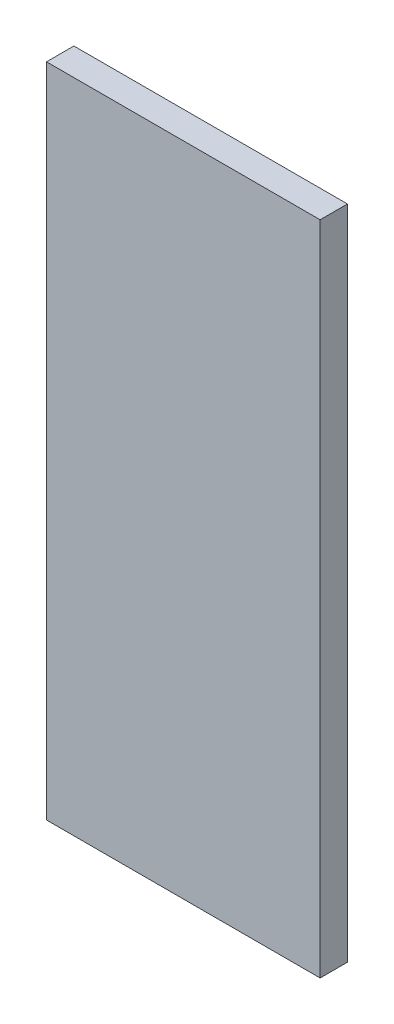
ISO-10303-21;
HEADER;
FILE_DESCRIPTION(('STEP AP214'),'2;1');
FILE_NAME('part.step','',(''),(''),'','','');
FILE_SCHEMA(('AUTOMOTIVE_DESIGN { 1 0 10303 214 1 1 1 1 }'));
ENDSEC;
DATA;
#1=APPLICATION_CONTEXT('core data for automotive mechanical design processes');
#2=APPLICATION_PROTOCOL_DEFINITION('international standard','automotive_design',2000,#1);
#3=PRODUCT_CONTEXT('',#1,'mechanical');
#4=PRODUCT('Part','Part','',(#3));
#5=PRODUCT_RELATED_PRODUCT_CATEGORY('part','',(#4));
#6=PRODUCT_DEFINITION_FORMATION('','',#4);
#7=PRODUCT_DEFINITION_CONTEXT('part definition',#1,'design');
#8=PRODUCT_DEFINITION('design','',#6,#7);
#9=PRODUCT_DEFINITION_SHAPE('','',#8);
#10=(LENGTH_UNIT() NAMED_UNIT(*) SI_UNIT(.MILLI.,.METRE.));
#11=(NAMED_UNIT(*) PLANE_ANGLE_UNIT() SI_UNIT($,.RADIAN.));
#12=(NAMED_UNIT(*) SI_UNIT($,.STERADIAN.) SOLID_ANGLE_UNIT());
#13=UNCERTAINTY_MEASURE_WITH_UNIT(LENGTH_MEASURE(1.E-05),#10,'distance_accuracy_value','');
#14=(GEOMETRIC_REPRESENTATION_CONTEXT(3) GLOBAL_UNCERTAINTY_ASSIGNED_CONTEXT((#13)) GLOBAL_UNIT_ASSIGNED_CONTEXT((#10,
#11,#12)) REPRESENTATION_CONTEXT('',''));
#15=CARTESIAN_POINT('',(0.,0.,0.));
#16=DIRECTION('',(0.,0.,1.));
#17=DIRECTION('',(1.,0.,0.));
#18=AXIS2_PLACEMENT_3D('',#15,#16,#17);
#19=CARTESIAN_POINT('',(-1397.960453354,-40.7409785932722,6.35));
#20=DIRECTION('',(1.,0.,0.));
#21=DIRECTION('',(0.,0.,-1.));
#22=AXIS2_PLACEMENT_3D('',#19,#20,#21);
#23=PLANE('',#22);
#24=DIRECTION('',(0.,-1.,0.));
#25=VECTOR('',#24,1.);
#26=CARTESIAN_POINT('',(-1397.960453354,-40.7409785932722,0.));
#27=LINE('',#26,#25);
#28=CARTESIAN_POINT('',(-1397.960453354,111.659021406728,0.));
#29=VERTEX_POINT('',#28);
#30=CARTESIAN_POINT('',(-1397.960453354,-40.7409785932722,0.));
#31=VERTEX_POINT('',#30);
#32=EDGE_CURVE('E102',#29,#31,#27,.T.);
#33=ORIENTED_EDGE('',*,*,#32,.T.);
#34=DIRECTION('',(0.,0.,-1.));
#35=VECTOR('',#34,1.);
#36=CARTESIAN_POINT('',(-1397.960453354,-40.7409785932722,6.35));
#37=LINE('',#36,#35);
#38=CARTESIAN_POINT('',(-1397.960453354,-40.7409785932722,6.35));
#39=VERTEX_POINT('',#38);
#40=EDGE_CURVE('E11',#39,#31,#37,.T.);
#41=ORIENTED_EDGE('',*,*,#40,.F.);
#42=DIRECTION('',(0.,-1.,0.));
#43=VECTOR('',#42,1.);
#44=CARTESIAN_POINT('',(-1397.960453354,-40.7409785932722,6.35));
#45=LINE('',#44,#43);
#46=CARTESIAN_POINT('',(-1397.960453354,111.659021406728,6.35));
#47=VERTEX_POINT('',#46);
#48=EDGE_CURVE('E90',#47,#39,#45,.T.);
#49=ORIENTED_EDGE('',*,*,#48,.F.);
#50=DIRECTION('',(0.,0.,-1.));
#51=VECTOR('',#50,1.);
#52=CARTESIAN_POINT('',(-1397.960453354,111.659021406728,6.35));
#53=LINE('',#52,#51);
#54=EDGE_CURVE('E98',#47,#29,#53,.T.);
#55=ORIENTED_EDGE('',*,*,#54,.T.);
#56=EDGE_LOOP('',(#33,#41,#49,#55));
#57=FACE_BOUND('',#56,.T.);
#58=ADVANCED_FACE('F39',(#57),#23,.F.);
#59=CARTESIAN_POINT('',(-1397.960453354,-40.7409785932722,6.35));
#60=DIRECTION('',(0.,1.,0.));
#61=DIRECTION('',(0.,0.,1.));
#62=AXIS2_PLACEMENT_3D('',#59,#60,#61);
#63=PLANE('',#62);
#64=DIRECTION('',(1.,0.,0.));
#65=VECTOR('',#64,1.);
#66=CARTESIAN_POINT('',(-1397.960453354,-40.7409785932722,0.));
#67=LINE('',#66,#65);
#68=CARTESIAN_POINT('',(-1334.46045335399,-40.7409785932722,0.));
#69=VERTEX_POINT('',#68);
#70=EDGE_CURVE('E94',#31,#69,#67,.T.);
#71=ORIENTED_EDGE('',*,*,#70,.T.);
#72=DIRECTION('',(0.,0.,-1.));
#73=VECTOR('',#72,1.);
#74=CARTESIAN_POINT('',(-1334.46045335399,-40.7409785932722,6.35));
#75=LINE('',#74,#73);
#76=CARTESIAN_POINT('',(-1334.46045335399,-40.7409785932722,6.35));
#77=VERTEX_POINT('',#76);
#78=EDGE_CURVE('E47',#77,#69,#75,.T.);
#79=ORIENTED_EDGE('',*,*,#78,.F.);
#80=DIRECTION('',(1.,0.,0.));
#81=VECTOR('',#80,1.);
#82=CARTESIAN_POINT('',(-1397.960453354,-40.7409785932722,6.35));
#83=LINE('',#82,#81);
#84=EDGE_CURVE('E85',#39,#77,#83,.T.);
#85=ORIENTED_EDGE('',*,*,#84,.F.);
#86=ORIENTED_EDGE('',*,*,#40,.T.);
#87=EDGE_LOOP('',(#71,#79,#85,#86));
#88=FACE_BOUND('',#87,.T.);
#89=ADVANCED_FACE('F93',(#88),#63,.F.);
#90=CARTESIAN_POINT('',(-1334.46045335399,-40.7409785932722,6.35));
#91=DIRECTION('',(-1.,0.,0.));
#92=DIRECTION('',(0.,0.,1.));
#93=AXIS2_PLACEMENT_3D('',#90,#91,#92);
#94=PLANE('',#93);
#95=DIRECTION('',(0.,1.,0.));
#96=VECTOR('',#95,1.);
#97=CARTESIAN_POINT('',(-1334.46045335399,-40.7409785932722,0.));
#98=LINE('',#97,#96);
#99=CARTESIAN_POINT('',(-1334.46045335399,111.659021406728,0.));
#100=VERTEX_POINT('',#99);
#101=EDGE_CURVE('E72',#69,#100,#98,.T.);
#102=ORIENTED_EDGE('',*,*,#101,.T.);
#103=DIRECTION('',(0.,0.,-1.));
#104=VECTOR('',#103,1.);
#105=CARTESIAN_POINT('',(-1334.46045335399,111.659021406728,6.35));
#106=LINE('',#105,#104);
#107=CARTESIAN_POINT('',(-1334.46045335399,111.659021406728,6.35));
#108=VERTEX_POINT('',#107);
#109=EDGE_CURVE('E95',#108,#100,#106,.T.);
#110=ORIENTED_EDGE('',*,*,#109,.F.);
#111=DIRECTION('',(0.,1.,0.));
#112=VECTOR('',#111,1.);
#113=CARTESIAN_POINT('',(-1334.46045335399,-40.7409785932722,6.35));
#114=LINE('',#113,#112);
#115=EDGE_CURVE('E88',#77,#108,#114,.T.);
#116=ORIENTED_EDGE('',*,*,#115,.F.);
#117=ORIENTED_EDGE('',*,*,#78,.T.);
#118=EDGE_LOOP('',(#102,#110,#116,#117));
#119=FACE_BOUND('',#118,.T.);
#120=ADVANCED_FACE('F96',(#119),#94,.F.);
#121=CARTESIAN_POINT('',(-1397.960453354,111.659021406728,6.35));
#122=DIRECTION('',(0.,-1.,0.));
#123=DIRECTION('',(0.,0.,-1.));
#124=AXIS2_PLACEMENT_3D('',#121,#122,#123);
#125=PLANE('',#124);
#126=DIRECTION('',(-1.,0.,0.));
#127=VECTOR('',#126,1.);
#128=CARTESIAN_POINT('',(-1397.960453354,111.659021406728,0.));
#129=LINE('',#128,#127);
#130=EDGE_CURVE('E78',#100,#29,#129,.T.);
#131=ORIENTED_EDGE('',*,*,#130,.T.);
#132=ORIENTED_EDGE('',*,*,#54,.F.);
#133=DIRECTION('',(-1.,0.,0.));
#134=VECTOR('',#133,1.);
#135=CARTESIAN_POINT('',(-1397.960453354,111.659021406728,6.35));
#136=LINE('',#135,#134);
#137=EDGE_CURVE('E55',#108,#47,#136,.T.);
#138=ORIENTED_EDGE('',*,*,#137,.F.);
#139=ORIENTED_EDGE('',*,*,#109,.T.);
#140=EDGE_LOOP('',(#131,#132,#138,#139));
#141=FACE_BOUND('',#140,.T.);
#142=ADVANCED_FACE('F109',(#141),#125,.F.);
#143=CARTESIAN_POINT('',(0.,0.,6.35));
#144=DIRECTION('',(0.,0.,-1.));
#145=DIRECTION('',(-1.,0.,0.));
#146=AXIS2_PLACEMENT_3D('',#143,#144,#145);
#147=PLANE('',#146);
#148=ORIENTED_EDGE('',*,*,#48,.T.);
#149=ORIENTED_EDGE('',*,*,#84,.T.);
#150=ORIENTED_EDGE('',*,*,#115,.T.);
#151=ORIENTED_EDGE('',*,*,#137,.T.);
#152=EDGE_LOOP('',(#148,#149,#150,#151));
#153=FACE_BOUND('',#152,.T.);
#154=ADVANCED_FACE('F86',(#153),#147,.F.);
#155=CARTESIAN_POINT('',(0.,0.,0.));
#156=DIRECTION('',(0.,0.,-1.));
#157=DIRECTION('',(-1.,0.,0.));
#158=AXIS2_PLACEMENT_3D('',#155,#156,#157);
#159=PLANE('',#158);
#160=ORIENTED_EDGE('',*,*,#32,.F.);
#161=ORIENTED_EDGE('',*,*,#130,.F.);
#162=ORIENTED_EDGE('',*,*,#101,.F.);
#163=ORIENTED_EDGE('',*,*,#70,.F.);
#164=EDGE_LOOP('',(#160,#161,#162,#163));
#165=FACE_BOUND('',#164,.T.);
#166=ADVANCED_FACE('F112',(#165),#159,.T.);
#167=CLOSED_SHELL('',(#58,#89,#120,#142,#154,#166));
#168=MANIFOLD_SOLID_BREP('B2',#167);
#169=ADVANCED_BREP_SHAPE_REPRESENTATION('',(#18,#168),#14);
#170=SHAPE_DEFINITION_REPRESENTATION(#9,#169);
ENDSEC;
END-ISO-10303-21;
